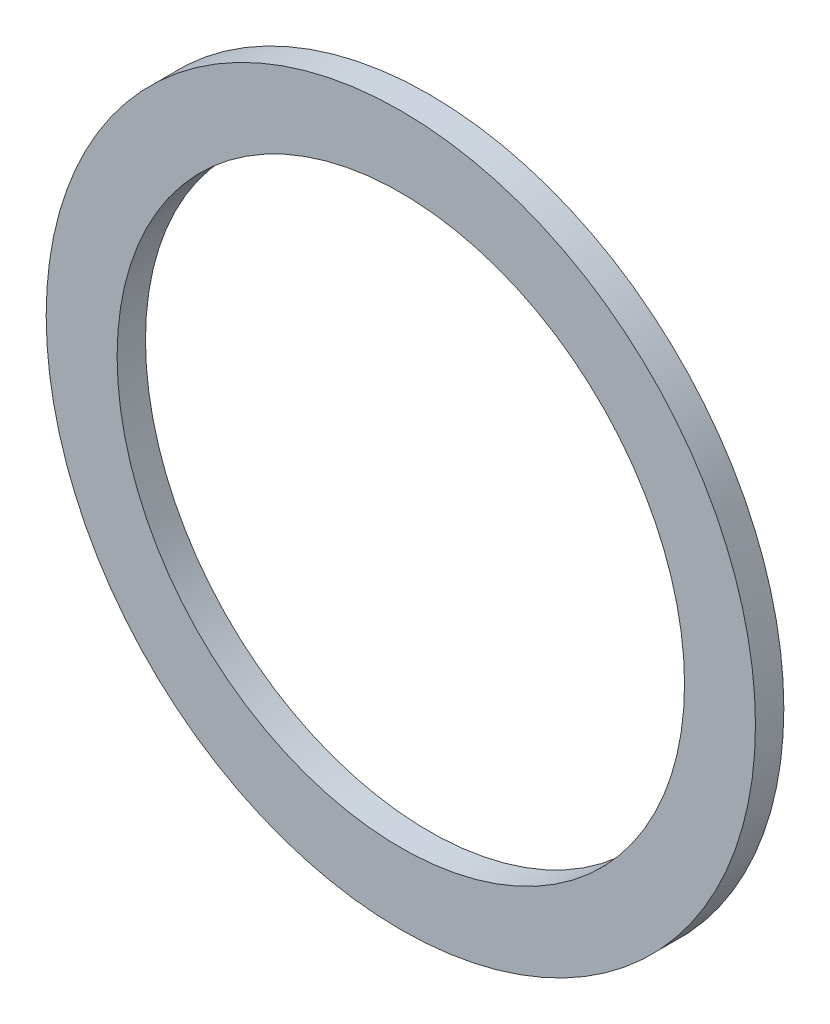
ISO-10303-21;
HEADER;
FILE_DESCRIPTION(('STEP AP214'),'2;1');
FILE_NAME('part.step','',(''),(''),'','','');
FILE_SCHEMA(('AUTOMOTIVE_DESIGN { 1 0 10303 214 1 1 1 1 }'));
ENDSEC;
DATA;
#1=APPLICATION_CONTEXT('core data for automotive mechanical design processes');
#2=APPLICATION_PROTOCOL_DEFINITION('international standard','automotive_design',2000,#1);
#3=PRODUCT_CONTEXT('',#1,'mechanical');
#4=PRODUCT('Part','Part','',(#3));
#5=PRODUCT_RELATED_PRODUCT_CATEGORY('part','',(#4));
#6=PRODUCT_DEFINITION_FORMATION('','',#4);
#7=PRODUCT_DEFINITION_CONTEXT('part definition',#1,'design');
#8=PRODUCT_DEFINITION('design','',#6,#7);
#9=PRODUCT_DEFINITION_SHAPE('','',#8);
#10=(LENGTH_UNIT() NAMED_UNIT(*) SI_UNIT(.MILLI.,.METRE.));
#11=(NAMED_UNIT(*) PLANE_ANGLE_UNIT() SI_UNIT($,.RADIAN.));
#12=(NAMED_UNIT(*) SI_UNIT($,.STERADIAN.) SOLID_ANGLE_UNIT());
#13=UNCERTAINTY_MEASURE_WITH_UNIT(LENGTH_MEASURE(1.E-05),#10,'distance_accuracy_value','');
#14=(GEOMETRIC_REPRESENTATION_CONTEXT(3) GLOBAL_UNCERTAINTY_ASSIGNED_CONTEXT((#13)) GLOBAL_UNIT_ASSIGNED_CONTEXT((#10,
#11,#12)) REPRESENTATION_CONTEXT('',''));
#15=CARTESIAN_POINT('',(0.,0.,0.));
#16=DIRECTION('',(0.,0.,1.));
#17=DIRECTION('',(1.,0.,0.));
#18=AXIS2_PLACEMENT_3D('',#15,#16,#17);
#19=CARTESIAN_POINT('',(0.,0.,-5.50000000000016));
#20=DIRECTION('',(0.,0.,1.));
#21=DIRECTION('',(1.,0.,0.));
#22=AXIS2_PLACEMENT_3D('',#19,#20,#21);
#23=TOROIDAL_SURFACE('',#22,45.,2.99999999999999);
#24=CARTESIAN_POINT('',(0.,0.,-4.00000000000015));
#25=DIRECTION('',(0.,0.,1.));
#26=DIRECTION('',(1.,0.,0.));
#27=AXIS2_PLACEMENT_3D('',#24,#25,#26);
#28=CIRCLE('',#27,42.4019237886467);
#29=CARTESIAN_POINT('',(42.4019237886467,0.,-4.00000000000029));
#30=VERTEX_POINT('',#29);
#31=EDGE_CURVE('E54',#30,#30,#28,.T.);
#32=ORIENTED_EDGE('',*,*,#31,.T.);
#33=EDGE_LOOP('',(#32));
#34=FACE_BOUND('',#33,.T.);
#35=CARTESIAN_POINT('',(0.,0.,-4.00000000000016));
#36=DIRECTION('',(0.,0.,1.));
#37=DIRECTION('',(1.,0.,0.));
#38=AXIS2_PLACEMENT_3D('',#35,#36,#37);
#39=CIRCLE('',#38,47.5980762113533);
#40=CARTESIAN_POINT('',(47.5980762113533,0.,-4.00000000000033));
#41=VERTEX_POINT('',#40);
#42=EDGE_CURVE('E10',#41,#41,#39,.T.);
#43=ORIENTED_EDGE('',*,*,#42,.F.);
#44=EDGE_LOOP('',(#43));
#45=FACE_BOUND('',#44,.T.);
#46=ADVANCED_FACE('F32',(#34,#45),#23,.F.);
#47=CARTESIAN_POINT('',(0.,0.,-4.00000000000017));
#48=DIRECTION('',(0.,0.,-1.));
#49=DIRECTION('',(-1.,0.,0.));
#50=AXIS2_PLACEMENT_3D('',#47,#48,#49);
#51=PLANE('',#50);
#52=ORIENTED_EDGE('',*,*,#42,.T.);
#53=EDGE_LOOP('',(#52));
#54=FACE_BOUND('',#53,.T.);
#55=CARTESIAN_POINT('',(0.,0.,-4.00000000000017));
#56=DIRECTION('',(0.,0.,1.));
#57=DIRECTION('',(1.,0.,0.));
#58=AXIS2_PLACEMENT_3D('',#55,#56,#57);
#59=CIRCLE('',#58,50.);
#60=CARTESIAN_POINT('',(50.,0.,-4.00000000000035));
#61=VERTEX_POINT('',#60);
#62=EDGE_CURVE('E38',#61,#61,#59,.T.);
#63=ORIENTED_EDGE('',*,*,#62,.F.);
#64=EDGE_LOOP('',(#63));
#65=FACE_BOUND('',#64,.T.);
#66=ADVANCED_FACE('F72',(#54,#65),#51,.T.);
#67=CARTESIAN_POINT('',(0.,0.,0.));
#68=DIRECTION('',(0.,0.,1.));
#69=DIRECTION('',(1.,0.,0.));
#70=AXIS2_PLACEMENT_3D('',#67,#68,#69);
#71=CYLINDRICAL_SURFACE('',#70,50.);
#72=ORIENTED_EDGE('',*,*,#62,.T.);
#73=EDGE_LOOP('',(#72));
#74=FACE_BOUND('',#73,.T.);
#75=CARTESIAN_POINT('',(0.,0.,-1.70615022737418E-13));
#76=DIRECTION('',(0.,0.,1.));
#77=DIRECTION('',(1.,0.,0.));
#78=AXIS2_PLACEMENT_3D('',#75,#76,#77);
#79=CIRCLE('',#78,50.);
#80=CARTESIAN_POINT('',(50.,0.,-3.45094472500732E-13));
#81=VERTEX_POINT('',#80);
#82=EDGE_CURVE('E42',#81,#81,#79,.T.);
#83=ORIENTED_EDGE('',*,*,#82,.F.);
#84=EDGE_LOOP('',(#83));
#85=FACE_BOUND('',#84,.T.);
#86=ADVANCED_FACE('F76',(#74,#85),#71,.T.);
#87=CARTESIAN_POINT('',(0.,0.,-1.53364567798058E-13));
#88=DIRECTION('',(0.,0.,1.));
#89=DIRECTION('',(1.,0.,0.));
#90=AXIS2_PLACEMENT_3D('',#87,#88,#89);
#91=PLANE('',#90);
#92=ORIENTED_EDGE('',*,*,#82,.T.);
#93=EDGE_LOOP('',(#92));
#94=FACE_BOUND('',#93,.T.);
#95=CARTESIAN_POINT('',(0.,0.,-1.36114112858697E-13));
#96=DIRECTION('',(0.,0.,1.));
#97=DIRECTION('',(1.,0.,0.));
#98=AXIS2_PLACEMENT_3D('',#95,#96,#97);
#99=CIRCLE('',#98,40.);
#100=CARTESIAN_POINT('',(40.,0.,-2.75697672669348E-13));
#101=VERTEX_POINT('',#100);
#102=EDGE_CURVE('E46',#101,#101,#99,.T.);
#103=ORIENTED_EDGE('',*,*,#102,.F.);
#104=EDGE_LOOP('',(#103));
#105=FACE_BOUND('',#104,.T.);
#106=ADVANCED_FACE('F68',(#94,#105),#91,.T.);
#107=CARTESIAN_POINT('',(0.,0.,0.));
#108=DIRECTION('',(0.,0.,1.));
#109=DIRECTION('',(1.,0.,0.));
#110=AXIS2_PLACEMENT_3D('',#107,#108,#109);
#111=CYLINDRICAL_SURFACE('',#110,40.);
#112=ORIENTED_EDGE('',*,*,#102,.T.);
#113=EDGE_LOOP('',(#112));
#114=FACE_BOUND('',#113,.T.);
#115=CARTESIAN_POINT('',(0.,0.,-4.00000000000014));
#116=DIRECTION('',(0.,0.,1.));
#117=DIRECTION('',(1.,0.,0.));
#118=AXIS2_PLACEMENT_3D('',#115,#116,#117);
#119=CIRCLE('',#118,40.);
#120=CARTESIAN_POINT('',(40.,0.,-4.00000000000028));
#121=VERTEX_POINT('',#120);
#122=EDGE_CURVE('E51',#121,#121,#119,.T.);
#123=ORIENTED_EDGE('',*,*,#122,.F.);
#124=EDGE_LOOP('',(#123));
#125=FACE_BOUND('',#124,.T.);
#126=ADVANCED_FACE('F62',(#114,#125),#111,.F.);
#127=CARTESIAN_POINT('',(0.,0.,-4.00000000000014));
#128=DIRECTION('',(0.,0.,-1.));
#129=DIRECTION('',(-1.,0.,0.));
#130=AXIS2_PLACEMENT_3D('',#127,#128,#129);
#131=PLANE('',#130);
#132=ORIENTED_EDGE('',*,*,#122,.T.);
#133=EDGE_LOOP('',(#132));
#134=FACE_BOUND('',#133,.T.);
#135=ORIENTED_EDGE('',*,*,#31,.F.);
#136=EDGE_LOOP('',(#135));
#137=FACE_BOUND('',#136,.T.);
#138=ADVANCED_FACE('F60',(#134,#137),#131,.T.);
#139=CLOSED_SHELL('',(#46,#66,#86,#106,#126,#138));
#140=MANIFOLD_SOLID_BREP('B2',#139);
#141=ADVANCED_BREP_SHAPE_REPRESENTATION('',(#18,#140),#14);
#142=SHAPE_DEFINITION_REPRESENTATION(#9,#141);
ENDSEC;
END-ISO-10303-21;
